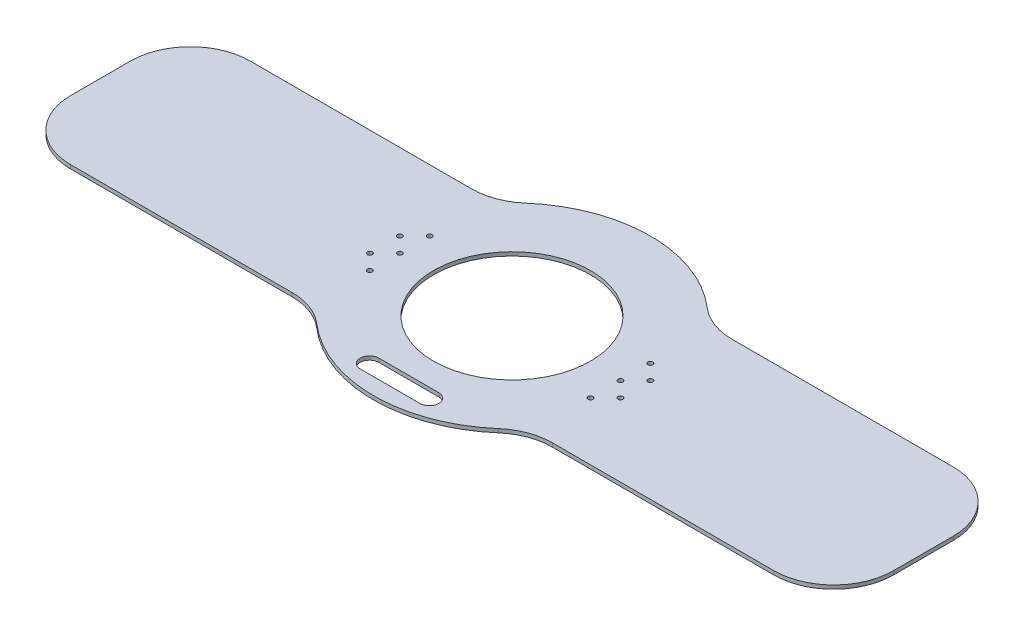
ISO-10303-21;
HEADER;
FILE_DESCRIPTION(('STEP AP214'),'2;1');
FILE_NAME('part.step','',(''),(''),'','','');
FILE_SCHEMA(('AUTOMOTIVE_DESIGN { 1 0 10303 214 1 1 1 1 }'));
ENDSEC;
DATA;
#1=APPLICATION_CONTEXT('core data for automotive mechanical design processes');
#2=APPLICATION_PROTOCOL_DEFINITION('international standard','automotive_design',2000,#1);
#3=PRODUCT_CONTEXT('',#1,'mechanical');
#4=PRODUCT('Part','Part','',(#3));
#5=PRODUCT_RELATED_PRODUCT_CATEGORY('part','',(#4));
#6=PRODUCT_DEFINITION_FORMATION('','',#4);
#7=PRODUCT_DEFINITION_CONTEXT('part definition',#1,'design');
#8=PRODUCT_DEFINITION('design','',#6,#7);
#9=PRODUCT_DEFINITION_SHAPE('','',#8);
#10=(LENGTH_UNIT() NAMED_UNIT(*) SI_UNIT(.MILLI.,.METRE.));
#11=(NAMED_UNIT(*) PLANE_ANGLE_UNIT() SI_UNIT($,.RADIAN.));
#12=(NAMED_UNIT(*) SI_UNIT($,.STERADIAN.) SOLID_ANGLE_UNIT());
#13=UNCERTAINTY_MEASURE_WITH_UNIT(LENGTH_MEASURE(1.E-05),#10,'distance_accuracy_value','');
#14=(GEOMETRIC_REPRESENTATION_CONTEXT(3) GLOBAL_UNCERTAINTY_ASSIGNED_CONTEXT((#13)) GLOBAL_UNIT_ASSIGNED_CONTEXT((#10,
#11,#12)) REPRESENTATION_CONTEXT('',''));
#15=CARTESIAN_POINT('',(0.,0.,0.));
#16=DIRECTION('',(0.,0.,1.));
#17=DIRECTION('',(1.,0.,0.));
#18=AXIS2_PLACEMENT_3D('',#15,#16,#17);
#19=CARTESIAN_POINT('',(-110.396900432032,3.175,127.));
#20=DIRECTION('',(0.,-1.,0.));
#21=DIRECTION('',(0.,0.,-1.));
#22=AXIS2_PLACEMENT_3D('',#19,#20,#21);
#23=CYLINDRICAL_SURFACE('',#22,50.8);
#24=CARTESIAN_POINT('',(-110.396900432032,0.,127.));
#25=DIRECTION('',(0.,1.,0.));
#26=DIRECTION('',(0.,0.,1.));
#27=AXIS2_PLACEMENT_3D('',#24,#25,#26);
#28=CIRCLE('',#27,50.8);
#29=CARTESIAN_POINT('',(-110.396900432032,0.,76.2));
#30=VERTEX_POINT('',#29);
#31=CARTESIAN_POINT('',(-77.0695342638714,0.,88.6603773584906));
#32=VERTEX_POINT('',#31);
#33=EDGE_CURVE('E252',#30,#32,#28,.F.);
#34=ORIENTED_EDGE('',*,*,#33,.T.);
#35=DIRECTION('',(0.,-1.,0.));
#36=VECTOR('',#35,1.);
#37=CARTESIAN_POINT('',(-77.0695342638714,3.175,88.6603773584906));
#38=LINE('',#37,#36);
#39=CARTESIAN_POINT('',(-77.0695342638714,3.175,88.6603773584906));
#40=VERTEX_POINT('',#39);
#41=EDGE_CURVE('E11',#40,#32,#38,.T.);
#42=ORIENTED_EDGE('',*,*,#41,.F.);
#43=CARTESIAN_POINT('',(-110.396900432032,3.175,127.));
#44=DIRECTION('',(0.,1.,0.));
#45=DIRECTION('',(0.,0.,1.));
#46=AXIS2_PLACEMENT_3D('',#43,#44,#45);
#47=CIRCLE('',#46,50.8);
#48=CARTESIAN_POINT('',(-110.396900432032,3.175,76.2));
#49=VERTEX_POINT('',#48);
#50=EDGE_CURVE('E207',#49,#40,#47,.F.);
#51=ORIENTED_EDGE('',*,*,#50,.F.);
#52=DIRECTION('',(0.,-1.,0.));
#53=VECTOR('',#52,1.);
#54=CARTESIAN_POINT('',(-110.396900432032,3.175,76.2));
#55=LINE('',#54,#53);
#56=EDGE_CURVE('E249',#49,#30,#55,.T.);
#57=ORIENTED_EDGE('',*,*,#56,.T.);
#58=EDGE_LOOP('',(#34,#42,#51,#57));
#59=FACE_BOUND('',#58,.T.);
#60=ADVANCED_FACE('F35',(#59),#23,.F.);
#61=CARTESIAN_POINT('',(0.,3.175,0.));
#62=DIRECTION('',(0.,-1.,0.));
#63=DIRECTION('',(0.,0.,-1.));
#64=AXIS2_PLACEMENT_3D('',#61,#62,#63);
#65=CYLINDRICAL_SURFACE('',#64,117.475);
#66=CARTESIAN_POINT('',(0.,0.,0.));
#67=DIRECTION('',(0.,1.,0.));
#68=DIRECTION('',(0.,0.,1.));
#69=AXIS2_PLACEMENT_3D('',#66,#67,#68);
#70=CIRCLE('',#69,117.475);
#71=CARTESIAN_POINT('',(77.0695342638714,0.,88.6603773584905));
#72=VERTEX_POINT('',#71);
#73=EDGE_CURVE('E255',#32,#72,#70,.T.);
#74=ORIENTED_EDGE('',*,*,#73,.T.);
#75=DIRECTION('',(0.,-1.,0.));
#76=VECTOR('',#75,1.);
#77=CARTESIAN_POINT('',(77.0695342638714,3.175,88.6603773584905));
#78=LINE('',#77,#76);
#79=CARTESIAN_POINT('',(77.0695342638714,3.175,88.6603773584905));
#80=VERTEX_POINT('',#79);
#81=EDGE_CURVE('E43',#80,#72,#78,.T.);
#82=ORIENTED_EDGE('',*,*,#81,.F.);
#83=CARTESIAN_POINT('',(0.,3.175,0.));
#84=DIRECTION('',(0.,1.,0.));
#85=DIRECTION('',(0.,0.,1.));
#86=AXIS2_PLACEMENT_3D('',#83,#84,#85);
#87=CIRCLE('',#86,117.475);
#88=EDGE_CURVE('E211',#40,#80,#87,.T.);
#89=ORIENTED_EDGE('',*,*,#88,.F.);
#90=ORIENTED_EDGE('',*,*,#41,.T.);
#91=EDGE_LOOP('',(#74,#82,#89,#90));
#92=FACE_BOUND('',#91,.T.);
#93=ADVANCED_FACE('F331',(#92),#65,.T.);
#94=CARTESIAN_POINT('',(110.396900432032,3.175,127.));
#95=DIRECTION('',(0.,-1.,0.));
#96=DIRECTION('',(0.,0.,-1.));
#97=AXIS2_PLACEMENT_3D('',#94,#95,#96);
#98=CYLINDRICAL_SURFACE('',#97,50.8);
#99=CARTESIAN_POINT('',(110.396900432032,0.,127.));
#100=DIRECTION('',(0.,1.,0.));
#101=DIRECTION('',(0.,0.,1.));
#102=AXIS2_PLACEMENT_3D('',#99,#100,#101);
#103=CIRCLE('',#102,50.8);
#104=CARTESIAN_POINT('',(110.396900432032,0.,76.2));
#105=VERTEX_POINT('',#104);
#106=EDGE_CURVE('E258',#105,#72,#103,.T.);
#107=ORIENTED_EDGE('',*,*,#106,.F.);
#108=DIRECTION('',(0.,-1.,0.));
#109=VECTOR('',#108,1.);
#110=CARTESIAN_POINT('',(110.396900432032,3.175,76.2));
#111=LINE('',#110,#109);
#112=CARTESIAN_POINT('',(110.396900432032,3.175,76.2));
#113=VERTEX_POINT('',#112);
#114=EDGE_CURVE('E324',#113,#105,#111,.T.);
#115=ORIENTED_EDGE('',*,*,#114,.F.);
#116=CARTESIAN_POINT('',(110.396900432032,3.175,127.));
#117=DIRECTION('',(0.,1.,0.));
#118=DIRECTION('',(0.,0.,1.));
#119=AXIS2_PLACEMENT_3D('',#116,#117,#118);
#120=CIRCLE('',#119,50.8);
#121=EDGE_CURVE('E213',#113,#80,#120,.T.);
#122=ORIENTED_EDGE('',*,*,#121,.T.);
#123=ORIENTED_EDGE('',*,*,#81,.T.);
#124=EDGE_LOOP('',(#107,#115,#122,#123));
#125=FACE_BOUND('',#124,.T.);
#126=ADVANCED_FACE('F328',(#125),#98,.F.);
#127=CARTESIAN_POINT('',(0.,3.175,76.2));
#128=DIRECTION('',(0.,0.,1.));
#129=DIRECTION('',(1.,0.,0.));
#130=AXIS2_PLACEMENT_3D('',#127,#128,#129);
#131=PLANE('',#130);
#132=DIRECTION('',(-1.,0.,0.));
#133=VECTOR('',#132,1.);
#134=CARTESIAN_POINT('',(0.,0.,76.2));
#135=LINE('',#134,#133);
#136=CARTESIAN_POINT('',(298.45,0.,76.2));
#137=VERTEX_POINT('',#136);
#138=EDGE_CURVE('E261',#137,#105,#135,.T.);
#139=ORIENTED_EDGE('',*,*,#138,.F.);
#140=DIRECTION('',(0.,-1.,0.));
#141=VECTOR('',#140,1.);
#142=CARTESIAN_POINT('',(298.45,3.175,76.2));
#143=LINE('',#142,#141);
#144=CARTESIAN_POINT('',(298.45,3.175,76.2));
#145=VERTEX_POINT('',#144);
#146=EDGE_CURVE('E322',#145,#137,#143,.T.);
#147=ORIENTED_EDGE('',*,*,#146,.F.);
#148=DIRECTION('',(-1.,0.,0.));
#149=VECTOR('',#148,1.);
#150=CARTESIAN_POINT('',(0.,3.175,76.2));
#151=LINE('',#150,#149);
#152=EDGE_CURVE('E216',#145,#113,#151,.T.);
#153=ORIENTED_EDGE('',*,*,#152,.T.);
#154=ORIENTED_EDGE('',*,*,#114,.T.);
#155=EDGE_LOOP('',(#139,#147,#153,#154));
#156=FACE_BOUND('',#155,.T.);
#157=ADVANCED_FACE('F339',(#156),#131,.T.);
#158=CARTESIAN_POINT('',(298.45,3.175,25.4));
#159=DIRECTION('',(0.,-1.,0.));
#160=DIRECTION('',(0.,0.,-1.));
#161=AXIS2_PLACEMENT_3D('',#158,#159,#160);
#162=CYLINDRICAL_SURFACE('',#161,50.8);
#163=CARTESIAN_POINT('',(298.45,0.,25.4));
#164=DIRECTION('',(0.,1.,0.));
#165=DIRECTION('',(0.,0.,1.));
#166=AXIS2_PLACEMENT_3D('',#163,#164,#165);
#167=CIRCLE('',#166,50.8);
#168=CARTESIAN_POINT('',(349.25,0.,25.4));
#169=VERTEX_POINT('',#168);
#170=EDGE_CURVE('E264',#169,#137,#167,.F.);
#171=ORIENTED_EDGE('',*,*,#170,.F.);
#172=DIRECTION('',(0.,-1.,0.));
#173=VECTOR('',#172,1.);
#174=CARTESIAN_POINT('',(349.25,3.175,25.4));
#175=LINE('',#174,#173);
#176=CARTESIAN_POINT('',(349.25,3.175,25.4));
#177=VERTEX_POINT('',#176);
#178=EDGE_CURVE('E320',#177,#169,#175,.T.);
#179=ORIENTED_EDGE('',*,*,#178,.F.);
#180=CARTESIAN_POINT('',(298.45,3.175,25.4));
#181=DIRECTION('',(0.,1.,0.));
#182=DIRECTION('',(0.,0.,1.));
#183=AXIS2_PLACEMENT_3D('',#180,#181,#182);
#184=CIRCLE('',#183,50.8);
#185=EDGE_CURVE('E219',#177,#145,#184,.F.);
#186=ORIENTED_EDGE('',*,*,#185,.T.);
#187=ORIENTED_EDGE('',*,*,#146,.T.);
#188=EDGE_LOOP('',(#171,#179,#186,#187));
#189=FACE_BOUND('',#188,.T.);
#190=ADVANCED_FACE('F396',(#189),#162,.T.);
#191=CARTESIAN_POINT('',(349.25,3.175,0.));
#192=DIRECTION('',(1.,0.,0.));
#193=DIRECTION('',(0.,0.,-1.));
#194=AXIS2_PLACEMENT_3D('',#191,#192,#193);
#195=PLANE('',#194);
#196=DIRECTION('',(0.,0.,1.));
#197=VECTOR('',#196,1.);
#198=CARTESIAN_POINT('',(349.25,0.,0.));
#199=LINE('',#198,#197);
#200=CARTESIAN_POINT('',(349.25,0.,-25.4000000000001));
#201=VERTEX_POINT('',#200);
#202=EDGE_CURVE('E267',#201,#169,#199,.T.);
#203=ORIENTED_EDGE('',*,*,#202,.F.);
#204=DIRECTION('',(0.,-1.,0.));
#205=VECTOR('',#204,1.);
#206=CARTESIAN_POINT('',(349.25,3.175,-25.4000000000001));
#207=LINE('',#206,#205);
#208=CARTESIAN_POINT('',(349.25,3.175,-25.4000000000001));
#209=VERTEX_POINT('',#208);
#210=EDGE_CURVE('E318',#209,#201,#207,.T.);
#211=ORIENTED_EDGE('',*,*,#210,.F.);
#212=DIRECTION('',(0.,0.,1.));
#213=VECTOR('',#212,1.);
#214=CARTESIAN_POINT('',(349.25,3.175,0.));
#215=LINE('',#214,#213);
#216=EDGE_CURVE('E222',#209,#177,#215,.T.);
#217=ORIENTED_EDGE('',*,*,#216,.T.);
#218=ORIENTED_EDGE('',*,*,#178,.T.);
#219=EDGE_LOOP('',(#203,#211,#217,#218));
#220=FACE_BOUND('',#219,.T.);
#221=ADVANCED_FACE('F393',(#220),#195,.T.);
#222=CARTESIAN_POINT('',(298.45,3.175,-25.4000000000001));
#223=DIRECTION('',(0.,-1.,0.));
#224=DIRECTION('',(0.,0.,-1.));
#225=AXIS2_PLACEMENT_3D('',#222,#223,#224);
#226=CYLINDRICAL_SURFACE('',#225,50.8);
#227=CARTESIAN_POINT('',(298.45,0.,-25.4000000000001));
#228=DIRECTION('',(0.,1.,0.));
#229=DIRECTION('',(0.,0.,1.));
#230=AXIS2_PLACEMENT_3D('',#227,#228,#229);
#231=CIRCLE('',#230,50.8);
#232=CARTESIAN_POINT('',(298.45,0.,-76.2000000000001));
#233=VERTEX_POINT('',#232);
#234=EDGE_CURVE('E270',#233,#201,#231,.F.);
#235=ORIENTED_EDGE('',*,*,#234,.F.);
#236=DIRECTION('',(0.,-1.,0.));
#237=VECTOR('',#236,1.);
#238=CARTESIAN_POINT('',(298.45,3.175,-76.2000000000001));
#239=LINE('',#238,#237);
#240=CARTESIAN_POINT('',(298.45,3.175,-76.2000000000001));
#241=VERTEX_POINT('',#240);
#242=EDGE_CURVE('E316',#241,#233,#239,.T.);
#243=ORIENTED_EDGE('',*,*,#242,.F.);
#244=CARTESIAN_POINT('',(298.45,3.175,-25.4000000000001));
#245=DIRECTION('',(0.,1.,0.));
#246=DIRECTION('',(0.,0.,1.));
#247=AXIS2_PLACEMENT_3D('',#244,#245,#246);
#248=CIRCLE('',#247,50.8);
#249=EDGE_CURVE('E225',#241,#209,#248,.F.);
#250=ORIENTED_EDGE('',*,*,#249,.T.);
#251=ORIENTED_EDGE('',*,*,#210,.T.);
#252=EDGE_LOOP('',(#235,#243,#250,#251));
#253=FACE_BOUND('',#252,.T.);
#254=ADVANCED_FACE('F390',(#253),#226,.T.);
#255=CARTESIAN_POINT('',(0.,3.175,-76.2));
#256=DIRECTION('',(0.,0.,1.));
#257=DIRECTION('',(1.,0.,0.));
#258=AXIS2_PLACEMENT_3D('',#255,#256,#257);
#259=PLANE('',#258);
#260=DIRECTION('',(-1.,0.,0.));
#261=VECTOR('',#260,1.);
#262=CARTESIAN_POINT('',(0.,0.,-76.2));
#263=LINE('',#262,#261);
#264=CARTESIAN_POINT('',(110.396900432032,0.,-76.2));
#265=VERTEX_POINT('',#264);
#266=EDGE_CURVE('E273',#233,#265,#263,.T.);
#267=ORIENTED_EDGE('',*,*,#266,.T.);
#268=DIRECTION('',(0.,-1.,0.));
#269=VECTOR('',#268,1.);
#270=CARTESIAN_POINT('',(110.396900432032,3.175,-76.2));
#271=LINE('',#270,#269);
#272=CARTESIAN_POINT('',(110.396900432032,3.175,-76.2));
#273=VERTEX_POINT('',#272);
#274=EDGE_CURVE('E313',#273,#265,#271,.T.);
#275=ORIENTED_EDGE('',*,*,#274,.F.);
#276=DIRECTION('',(-1.,0.,0.));
#277=VECTOR('',#276,1.);
#278=CARTESIAN_POINT('',(0.,3.175,-76.2));
#279=LINE('',#278,#277);
#280=EDGE_CURVE('E228',#241,#273,#279,.T.);
#281=ORIENTED_EDGE('',*,*,#280,.F.);
#282=ORIENTED_EDGE('',*,*,#242,.T.);
#283=EDGE_LOOP('',(#267,#275,#281,#282));
#284=FACE_BOUND('',#283,.T.);
#285=ADVANCED_FACE('F387',(#284),#259,.F.);
#286=CARTESIAN_POINT('',(110.396900432032,3.175,-127.));
#287=DIRECTION('',(0.,-1.,0.));
#288=DIRECTION('',(0.,0.,-1.));
#289=AXIS2_PLACEMENT_3D('',#286,#287,#288);
#290=CYLINDRICAL_SURFACE('',#289,50.8);
#291=CARTESIAN_POINT('',(110.396900432032,0.,-127.));
#292=DIRECTION('',(0.,1.,0.));
#293=DIRECTION('',(0.,0.,1.));
#294=AXIS2_PLACEMENT_3D('',#291,#292,#293);
#295=CIRCLE('',#294,50.8);
#296=CARTESIAN_POINT('',(77.0695342638714,0.,-88.6603773584905));
#297=VERTEX_POINT('',#296);
#298=EDGE_CURVE('E275',#265,#297,#295,.F.);
#299=ORIENTED_EDGE('',*,*,#298,.T.);
#300=DIRECTION('',(0.,-1.,0.));
#301=VECTOR('',#300,1.);
#302=CARTESIAN_POINT('',(77.0695342638714,3.175,-88.6603773584905));
#303=LINE('',#302,#301);
#304=CARTESIAN_POINT('',(77.0695342638714,3.175,-88.6603773584905));
#305=VERTEX_POINT('',#304);
#306=EDGE_CURVE('E310',#305,#297,#303,.T.);
#307=ORIENTED_EDGE('',*,*,#306,.F.);
#308=CARTESIAN_POINT('',(110.396900432032,3.175,-127.));
#309=DIRECTION('',(0.,1.,0.));
#310=DIRECTION('',(0.,0.,1.));
#311=AXIS2_PLACEMENT_3D('',#308,#309,#310);
#312=CIRCLE('',#311,50.8);
#313=EDGE_CURVE('E230',#273,#305,#312,.F.);
#314=ORIENTED_EDGE('',*,*,#313,.F.);
#315=ORIENTED_EDGE('',*,*,#274,.T.);
#316=EDGE_LOOP('',(#299,#307,#314,#315));
#317=FACE_BOUND('',#316,.T.);
#318=ADVANCED_FACE('F382',(#317),#290,.F.);
#319=CARTESIAN_POINT('',(0.,3.175,0.));
#320=DIRECTION('',(0.,-1.,0.));
#321=DIRECTION('',(0.,0.,-1.));
#322=AXIS2_PLACEMENT_3D('',#319,#320,#321);
#323=CYLINDRICAL_SURFACE('',#322,117.475);
#324=CARTESIAN_POINT('',(0.,0.,0.));
#325=DIRECTION('',(0.,1.,0.));
#326=DIRECTION('',(0.,0.,1.));
#327=AXIS2_PLACEMENT_3D('',#324,#325,#326);
#328=CIRCLE('',#327,117.475);
#329=CARTESIAN_POINT('',(-77.0695342638714,0.,-88.6603773584906));
#330=VERTEX_POINT('',#329);
#331=EDGE_CURVE('E277',#297,#330,#328,.T.);
#332=ORIENTED_EDGE('',*,*,#331,.T.);
#333=DIRECTION('',(0.,-1.,0.));
#334=VECTOR('',#333,1.);
#335=CARTESIAN_POINT('',(-77.0695342638714,3.175,-88.6603773584906));
#336=LINE('',#335,#334);
#337=CARTESIAN_POINT('',(-77.0695342638714,3.175,-88.6603773584906));
#338=VERTEX_POINT('',#337);
#339=EDGE_CURVE('E308',#338,#330,#336,.T.);
#340=ORIENTED_EDGE('',*,*,#339,.F.);
#341=CARTESIAN_POINT('',(0.,3.175,0.));
#342=DIRECTION('',(0.,1.,0.));
#343=DIRECTION('',(0.,0.,1.));
#344=AXIS2_PLACEMENT_3D('',#341,#342,#343);
#345=CIRCLE('',#344,117.475);
#346=EDGE_CURVE('E232',#305,#338,#345,.T.);
#347=ORIENTED_EDGE('',*,*,#346,.F.);
#348=ORIENTED_EDGE('',*,*,#306,.T.);
#349=EDGE_LOOP('',(#332,#340,#347,#348));
#350=FACE_BOUND('',#349,.T.);
#351=ADVANCED_FACE('F376',(#350),#323,.T.);
#352=CARTESIAN_POINT('',(-110.396900432032,3.175,-127.));
#353=DIRECTION('',(0.,-1.,0.));
#354=DIRECTION('',(0.,0.,-1.));
#355=AXIS2_PLACEMENT_3D('',#352,#353,#354);
#356=CYLINDRICAL_SURFACE('',#355,50.8);
#357=CARTESIAN_POINT('',(-110.396900432032,0.,-127.));
#358=DIRECTION('',(0.,1.,0.));
#359=DIRECTION('',(0.,0.,1.));
#360=AXIS2_PLACEMENT_3D('',#357,#358,#359);
#361=CIRCLE('',#360,50.8);
#362=CARTESIAN_POINT('',(-110.396900432032,0.,-76.2));
#363=VERTEX_POINT('',#362);
#364=EDGE_CURVE('E280',#363,#330,#361,.T.);
#365=ORIENTED_EDGE('',*,*,#364,.F.);
#366=DIRECTION('',(0.,-1.,0.));
#367=VECTOR('',#366,1.);
#368=CARTESIAN_POINT('',(-110.396900432032,3.175,-76.2));
#369=LINE('',#368,#367);
#370=CARTESIAN_POINT('',(-110.396900432032,3.175,-76.2));
#371=VERTEX_POINT('',#370);
#372=EDGE_CURVE('E306',#371,#363,#369,.T.);
#373=ORIENTED_EDGE('',*,*,#372,.F.);
#374=CARTESIAN_POINT('',(-110.396900432032,3.175,-127.));
#375=DIRECTION('',(0.,1.,0.));
#376=DIRECTION('',(0.,0.,1.));
#377=AXIS2_PLACEMENT_3D('',#374,#375,#376);
#378=CIRCLE('',#377,50.8);
#379=EDGE_CURVE('E234',#371,#338,#378,.T.);
#380=ORIENTED_EDGE('',*,*,#379,.T.);
#381=ORIENTED_EDGE('',*,*,#339,.T.);
#382=EDGE_LOOP('',(#365,#373,#380,#381));
#383=FACE_BOUND('',#382,.T.);
#384=ADVANCED_FACE('F372',(#383),#356,.F.);
#385=CARTESIAN_POINT('',(0.,3.175,-76.2));
#386=DIRECTION('',(0.,0.,1.));
#387=DIRECTION('',(1.,0.,0.));
#388=AXIS2_PLACEMENT_3D('',#385,#386,#387);
#389=PLANE('',#388);
#390=DIRECTION('',(-1.,0.,0.));
#391=VECTOR('',#390,1.);
#392=CARTESIAN_POINT('',(0.,0.,-76.2));
#393=LINE('',#392,#391);
#394=CARTESIAN_POINT('',(-298.45,0.,-76.2));
#395=VERTEX_POINT('',#394);
#396=EDGE_CURVE('E283',#363,#395,#393,.T.);
#397=ORIENTED_EDGE('',*,*,#396,.T.);
#398=DIRECTION('',(0.,-1.,0.));
#399=VECTOR('',#398,1.);
#400=CARTESIAN_POINT('',(-298.45,3.175,-76.2));
#401=LINE('',#400,#399);
#402=CARTESIAN_POINT('',(-298.45,3.175,-76.2));
#403=VERTEX_POINT('',#402);
#404=EDGE_CURVE('E303',#403,#395,#401,.T.);
#405=ORIENTED_EDGE('',*,*,#404,.F.);
#406=DIRECTION('',(-1.,0.,0.));
#407=VECTOR('',#406,1.);
#408=CARTESIAN_POINT('',(0.,3.175,-76.2));
#409=LINE('',#408,#407);
#410=EDGE_CURVE('E237',#371,#403,#409,.T.);
#411=ORIENTED_EDGE('',*,*,#410,.F.);
#412=ORIENTED_EDGE('',*,*,#372,.T.);
#413=EDGE_LOOP('',(#397,#405,#411,#412));
#414=FACE_BOUND('',#413,.T.);
#415=ADVANCED_FACE('F367',(#414),#389,.F.);
#416=CARTESIAN_POINT('',(-298.45,3.175,-25.4));
#417=DIRECTION('',(0.,-1.,0.));
#418=DIRECTION('',(0.,0.,-1.));
#419=AXIS2_PLACEMENT_3D('',#416,#417,#418);
#420=CYLINDRICAL_SURFACE('',#419,50.8);
#421=CARTESIAN_POINT('',(-298.45,0.,-25.4));
#422=DIRECTION('',(0.,1.,0.));
#423=DIRECTION('',(0.,0.,1.));
#424=AXIS2_PLACEMENT_3D('',#421,#422,#423);
#425=CIRCLE('',#424,50.8);
#426=CARTESIAN_POINT('',(-349.25,0.,-25.4));
#427=VERTEX_POINT('',#426);
#428=EDGE_CURVE('E285',#395,#427,#425,.T.);
#429=ORIENTED_EDGE('',*,*,#428,.T.);
#430=DIRECTION('',(0.,-1.,0.));
#431=VECTOR('',#430,1.);
#432=CARTESIAN_POINT('',(-349.25,3.175,-25.4));
#433=LINE('',#432,#431);
#434=CARTESIAN_POINT('',(-349.25,3.175,-25.4));
#435=VERTEX_POINT('',#434);
#436=EDGE_CURVE('E300',#435,#427,#433,.T.);
#437=ORIENTED_EDGE('',*,*,#436,.F.);
#438=CARTESIAN_POINT('',(-298.45,3.175,-25.4));
#439=DIRECTION('',(0.,1.,0.));
#440=DIRECTION('',(0.,0.,1.));
#441=AXIS2_PLACEMENT_3D('',#438,#439,#440);
#442=CIRCLE('',#441,50.8);
#443=EDGE_CURVE('E239',#403,#435,#442,.T.);
#444=ORIENTED_EDGE('',*,*,#443,.F.);
#445=ORIENTED_EDGE('',*,*,#404,.T.);
#446=EDGE_LOOP('',(#429,#437,#444,#445));
#447=FACE_BOUND('',#446,.T.);
#448=ADVANCED_FACE('F363',(#447),#420,.T.);
#449=CARTESIAN_POINT('',(-349.25,3.175,0.));
#450=DIRECTION('',(1.,0.,0.));
#451=DIRECTION('',(0.,0.,-1.));
#452=AXIS2_PLACEMENT_3D('',#449,#450,#451);
#453=PLANE('',#452);
#454=DIRECTION('',(0.,0.,1.));
#455=VECTOR('',#454,1.);
#456=CARTESIAN_POINT('',(-349.25,0.,0.));
#457=LINE('',#456,#455);
#458=CARTESIAN_POINT('',(-349.25,0.,25.4));
#459=VERTEX_POINT('',#458);
#460=EDGE_CURVE('E287',#427,#459,#457,.T.);
#461=ORIENTED_EDGE('',*,*,#460,.T.);
#462=DIRECTION('',(0.,-1.,0.));
#463=VECTOR('',#462,1.);
#464=CARTESIAN_POINT('',(-349.25,3.175,25.4));
#465=LINE('',#464,#463);
#466=CARTESIAN_POINT('',(-349.25,3.175,25.4));
#467=VERTEX_POINT('',#466);
#468=EDGE_CURVE('E298',#467,#459,#465,.T.);
#469=ORIENTED_EDGE('',*,*,#468,.F.);
#470=DIRECTION('',(0.,0.,1.));
#471=VECTOR('',#470,1.);
#472=CARTESIAN_POINT('',(-349.25,3.175,0.));
#473=LINE('',#472,#471);
#474=EDGE_CURVE('E241',#435,#467,#473,.T.);
#475=ORIENTED_EDGE('',*,*,#474,.F.);
#476=ORIENTED_EDGE('',*,*,#436,.T.);
#477=EDGE_LOOP('',(#461,#469,#475,#476));
#478=FACE_BOUND('',#477,.T.);
#479=ADVANCED_FACE('F358',(#478),#453,.F.);
#480=CARTESIAN_POINT('',(-298.45,3.175,25.4));
#481=DIRECTION('',(0.,-1.,0.));
#482=DIRECTION('',(0.,0.,-1.));
#483=AXIS2_PLACEMENT_3D('',#480,#481,#482);
#484=CYLINDRICAL_SURFACE('',#483,50.8);
#485=CARTESIAN_POINT('',(-298.45,0.,25.4));
#486=DIRECTION('',(0.,1.,0.));
#487=DIRECTION('',(0.,0.,1.));
#488=AXIS2_PLACEMENT_3D('',#485,#486,#487);
#489=CIRCLE('',#488,50.8);
#490=CARTESIAN_POINT('',(-298.45,0.,76.2));
#491=VERTEX_POINT('',#490);
#492=EDGE_CURVE('E290',#491,#459,#489,.F.);
#493=ORIENTED_EDGE('',*,*,#492,.F.);
#494=DIRECTION('',(0.,-1.,0.));
#495=VECTOR('',#494,1.);
#496=CARTESIAN_POINT('',(-298.45,3.175,76.2));
#497=LINE('',#496,#495);
#498=CARTESIAN_POINT('',(-298.45,3.175,76.2));
#499=VERTEX_POINT('',#498);
#500=EDGE_CURVE('E296',#499,#491,#497,.T.);
#501=ORIENTED_EDGE('',*,*,#500,.F.);
#502=CARTESIAN_POINT('',(-298.45,3.175,25.4));
#503=DIRECTION('',(0.,1.,0.));
#504=DIRECTION('',(0.,0.,1.));
#505=AXIS2_PLACEMENT_3D('',#502,#503,#504);
#506=CIRCLE('',#505,50.8);
#507=EDGE_CURVE('E243',#499,#467,#506,.F.);
#508=ORIENTED_EDGE('',*,*,#507,.T.);
#509=ORIENTED_EDGE('',*,*,#468,.T.);
#510=EDGE_LOOP('',(#493,#501,#508,#509));
#511=FACE_BOUND('',#510,.T.);
#512=ADVANCED_FACE('F352',(#511),#484,.T.);
#513=CARTESIAN_POINT('',(0.,3.175,0.));
#514=DIRECTION('',(0.,-1.,0.));
#515=DIRECTION('',(0.,0.,-1.));
#516=AXIS2_PLACEMENT_3D('',#513,#514,#515);
#517=CYLINDRICAL_SURFACE('',#516,66.675);
#518=CARTESIAN_POINT('',(0.,3.175,0.));
#519=DIRECTION('',(0.,1.,0.));
#520=DIRECTION('',(0.,0.,1.));
#521=AXIS2_PLACEMENT_3D('',#518,#519,#520);
#522=CIRCLE('',#521,66.675);
#523=CARTESIAN_POINT('',(0.,3.175,66.675));
#524=VERTEX_POINT('',#523);
#525=EDGE_CURVE('E204',#524,#524,#522,.T.);
#526=ORIENTED_EDGE('',*,*,#525,.T.);
#527=EDGE_LOOP('',(#526));
#528=FACE_BOUND('',#527,.T.);
#529=CARTESIAN_POINT('',(0.,0.,0.));
#530=DIRECTION('',(0.,1.,0.));
#531=DIRECTION('',(0.,0.,1.));
#532=AXIS2_PLACEMENT_3D('',#529,#530,#531);
#533=CIRCLE('',#532,66.675);
#534=CARTESIAN_POINT('',(0.,0.,66.675));
#535=VERTEX_POINT('',#534);
#536=EDGE_CURVE('E202',#535,#535,#533,.T.);
#537=ORIENTED_EDGE('',*,*,#536,.F.);
#538=EDGE_LOOP('',(#537));
#539=FACE_BOUND('',#538,.T.);
#540=ADVANCED_FACE('F37',(#528,#539),#517,.F.);
#541=CARTESIAN_POINT('',(0.,3.175,76.2));
#542=DIRECTION('',(0.,0.,1.));
#543=DIRECTION('',(1.,0.,0.));
#544=AXIS2_PLACEMENT_3D('',#541,#542,#543);
#545=PLANE('',#544);
#546=DIRECTION('',(-1.,0.,0.));
#547=VECTOR('',#546,1.);
#548=CARTESIAN_POINT('',(0.,0.,76.2));
#549=LINE('',#548,#547);
#550=EDGE_CURVE('E208',#30,#491,#549,.T.);
#551=ORIENTED_EDGE('',*,*,#550,.F.);
#552=ORIENTED_EDGE('',*,*,#56,.F.);
#553=DIRECTION('',(-1.,0.,0.));
#554=VECTOR('',#553,1.);
#555=CARTESIAN_POINT('',(0.,3.175,76.2));
#556=LINE('',#555,#554);
#557=EDGE_CURVE('E246',#49,#499,#556,.T.);
#558=ORIENTED_EDGE('',*,*,#557,.T.);
#559=ORIENTED_EDGE('',*,*,#500,.T.);
#560=EDGE_LOOP('',(#551,#552,#558,#559));
#561=FACE_BOUND('',#560,.T.);
#562=ADVANCED_FACE('F349',(#561),#545,.T.);
#563=CARTESIAN_POINT('',(0.,3.175,0.));
#564=DIRECTION('',(0.,1.,0.));
#565=DIRECTION('',(0.,0.,1.));
#566=AXIS2_PLACEMENT_3D('',#563,#564,#565);
#567=PLANE('',#566);
#568=CARTESIAN_POINT('',(-106.3244,3.175,14.2875));
#569=DIRECTION('',(0.,1.,0.));
#570=DIRECTION('',(0.,0.,1.));
#571=AXIS2_PLACEMENT_3D('',#568,#569,#570);
#572=CIRCLE('',#571,2.0955);
#573=CARTESIAN_POINT('',(-106.3244,3.175,16.383));
#574=VERTEX_POINT('',#573);
#575=EDGE_CURVE('E681',#574,#574,#572,.T.);
#576=ORIENTED_EDGE('',*,*,#575,.F.);
#577=EDGE_LOOP('',(#576));
#578=FACE_BOUND('',#577,.T.);
#579=CARTESIAN_POINT('',(-93.6244000000001,3.175,1.58750000000001));
#580=DIRECTION('',(0.,1.,0.));
#581=DIRECTION('',(0.,0.,1.));
#582=AXIS2_PLACEMENT_3D('',#579,#580,#581);
#583=CIRCLE('',#582,2.0955);
#584=CARTESIAN_POINT('',(-93.6244000000001,3.175,3.68300000000001));
#585=VERTEX_POINT('',#584);
#586=EDGE_CURVE('E687',#585,#585,#583,.T.);
#587=ORIENTED_EDGE('',*,*,#586,.F.);
#588=EDGE_LOOP('',(#587));
#589=FACE_BOUND('',#588,.T.);
#590=CARTESIAN_POINT('',(-106.3244,3.175,-11.1125));
#591=DIRECTION('',(0.,1.,0.));
#592=DIRECTION('',(0.,0.,1.));
#593=AXIS2_PLACEMENT_3D('',#590,#591,#592);
#594=CIRCLE('',#593,2.0955);
#595=CARTESIAN_POINT('',(-106.3244,3.175,-9.01699999999999));
#596=VERTEX_POINT('',#595);
#597=EDGE_CURVE('E695',#596,#596,#594,.T.);
#598=ORIENTED_EDGE('',*,*,#597,.F.);
#599=EDGE_LOOP('',(#598));
#600=FACE_BOUND('',#599,.T.);
#601=CARTESIAN_POINT('',(-93.6244000000001,3.175,-23.8125));
#602=DIRECTION('',(0.,1.,0.));
#603=DIRECTION('',(0.,0.,1.));
#604=AXIS2_PLACEMENT_3D('',#601,#602,#603);
#605=CIRCLE('',#604,2.0955);
#606=CARTESIAN_POINT('',(-93.6244000000001,3.175,-21.717));
#607=VERTEX_POINT('',#606);
#608=EDGE_CURVE('E701',#607,#607,#605,.T.);
#609=ORIENTED_EDGE('',*,*,#608,.F.);
#610=EDGE_LOOP('',(#609));
#611=FACE_BOUND('',#610,.T.);
#612=CARTESIAN_POINT('',(93.6244000000001,3.175,26.9875));
#613=DIRECTION('',(0.,1.,0.));
#614=DIRECTION('',(0.,0.,-1.));
#615=AXIS2_PLACEMENT_3D('',#612,#613,#614);
#616=CIRCLE('',#615,2.0955);
#617=CARTESIAN_POINT('',(93.6244000000001,3.175,24.892));
#618=VERTEX_POINT('',#617);
#619=EDGE_CURVE('E707',#618,#618,#616,.T.);
#620=ORIENTED_EDGE('',*,*,#619,.F.);
#621=EDGE_LOOP('',(#620));
#622=FACE_BOUND('',#621,.T.);
#623=CARTESIAN_POINT('',(106.3244,3.175,14.2875));
#624=DIRECTION('',(0.,1.,0.));
#625=DIRECTION('',(0.,0.,-1.));
#626=AXIS2_PLACEMENT_3D('',#623,#624,#625);
#627=CIRCLE('',#626,2.0955);
#628=CARTESIAN_POINT('',(106.3244,3.175,12.192));
#629=VERTEX_POINT('',#628);
#630=EDGE_CURVE('E713',#629,#629,#627,.T.);
#631=ORIENTED_EDGE('',*,*,#630,.F.);
#632=EDGE_LOOP('',(#631));
#633=FACE_BOUND('',#632,.T.);
#634=CARTESIAN_POINT('',(93.6244000000001,3.175,1.58750000000001));
#635=DIRECTION('',(0.,1.,0.));
#636=DIRECTION('',(0.,0.,-1.));
#637=AXIS2_PLACEMENT_3D('',#634,#635,#636);
#638=CIRCLE('',#637,2.0955);
#639=CARTESIAN_POINT('',(93.6244000000001,3.175,-0.507999999999995));
#640=VERTEX_POINT('',#639);
#641=EDGE_CURVE('E719',#640,#640,#638,.T.);
#642=ORIENTED_EDGE('',*,*,#641,.F.);
#643=EDGE_LOOP('',(#642));
#644=FACE_BOUND('',#643,.T.);
#645=CARTESIAN_POINT('',(106.3244,3.175,-11.1125));
#646=DIRECTION('',(0.,1.,0.));
#647=DIRECTION('',(0.,0.,-1.));
#648=AXIS2_PLACEMENT_3D('',#645,#646,#647);
#649=CIRCLE('',#648,2.0955);
#650=CARTESIAN_POINT('',(106.3244,3.175,-13.208));
#651=VERTEX_POINT('',#650);
#652=EDGE_CURVE('E725',#651,#651,#649,.T.);
#653=ORIENTED_EDGE('',*,*,#652,.F.);
#654=EDGE_LOOP('',(#653));
#655=FACE_BOUND('',#654,.T.);
#656=CARTESIAN_POINT('',(93.6244000000001,3.175,-23.8125));
#657=DIRECTION('',(0.,1.,0.));
#658=DIRECTION('',(0.,0.,-1.));
#659=AXIS2_PLACEMENT_3D('',#656,#657,#658);
#660=CIRCLE('',#659,2.0955);
#661=CARTESIAN_POINT('',(93.6244000000001,3.175,-25.908));
#662=VERTEX_POINT('',#661);
#663=EDGE_CURVE('E731',#662,#662,#660,.T.);
#664=ORIENTED_EDGE('',*,*,#663,.F.);
#665=EDGE_LOOP('',(#664));
#666=FACE_BOUND('',#665,.T.);
#667=CARTESIAN_POINT('',(-93.6244000000001,3.175,26.9875));
#668=DIRECTION('',(0.,1.,0.));
#669=DIRECTION('',(0.,0.,1.));
#670=AXIS2_PLACEMENT_3D('',#667,#668,#669);
#671=CIRCLE('',#670,2.0955);
#672=CARTESIAN_POINT('',(-93.6244000000001,3.175,29.083));
#673=VERTEX_POINT('',#672);
#674=EDGE_CURVE('E684',#673,#673,#671,.T.);
#675=ORIENTED_EDGE('',*,*,#674,.F.);
#676=EDGE_LOOP('',(#675));
#677=FACE_BOUND('',#676,.T.);
#678=CARTESIAN_POINT('',(-25.4,3.175,95.49961469));
#679=DIRECTION('',(0.,1.,0.));
#680=DIRECTION('',(0.,0.,1.));
#681=AXIS2_PLACEMENT_3D('',#678,#679,#680);
#682=CIRCLE('',#681,7.9375);
#683=CARTESIAN_POINT('',(-25.4,3.175,87.56211469));
#684=VERTEX_POINT('',#683);
#685=CARTESIAN_POINT('',(-25.4,3.175,103.43711469));
#686=VERTEX_POINT('',#685);
#687=EDGE_CURVE('E50',#684,#686,#682,.T.);
#688=ORIENTED_EDGE('',*,*,#687,.F.);
#689=DIRECTION('',(-1.,0.,0.));
#690=VECTOR('',#689,1.);
#691=CARTESIAN_POINT('',(-25.4,3.175,87.56211469));
#692=LINE('',#691,#690);
#693=CARTESIAN_POINT('',(25.4,3.175,87.56211469));
#694=VERTEX_POINT('',#693);
#695=EDGE_CURVE('E191',#694,#684,#692,.T.);
#696=ORIENTED_EDGE('',*,*,#695,.F.);
#697=CARTESIAN_POINT('',(25.4,3.175,95.49961469));
#698=DIRECTION('',(0.,1.,0.));
#699=DIRECTION('',(0.,0.,1.));
#700=AXIS2_PLACEMENT_3D('',#697,#698,#699);
#701=CIRCLE('',#700,7.9375);
#702=CARTESIAN_POINT('',(25.4,3.175,103.43711469));
#703=VERTEX_POINT('',#702);
#704=EDGE_CURVE('E175',#703,#694,#701,.T.);
#705=ORIENTED_EDGE('',*,*,#704,.F.);
#706=DIRECTION('',(1.,0.,0.));
#707=VECTOR('',#706,1.);
#708=CARTESIAN_POINT('',(-25.4,3.175,103.43711469));
#709=LINE('',#708,#707);
#710=EDGE_CURVE('E184',#686,#703,#709,.T.);
#711=ORIENTED_EDGE('',*,*,#710,.F.);
#712=EDGE_LOOP('',(#688,#696,#705,#711));
#713=FACE_BOUND('',#712,.T.);
#714=ORIENTED_EDGE('',*,*,#525,.F.);
#715=EDGE_LOOP('',(#714));
#716=FACE_BOUND('',#715,.T.);
#717=ORIENTED_EDGE('',*,*,#50,.T.);
#718=ORIENTED_EDGE('',*,*,#88,.T.);
#719=ORIENTED_EDGE('',*,*,#121,.F.);
#720=ORIENTED_EDGE('',*,*,#152,.F.);
#721=ORIENTED_EDGE('',*,*,#185,.F.);
#722=ORIENTED_EDGE('',*,*,#216,.F.);
#723=ORIENTED_EDGE('',*,*,#249,.F.);
#724=ORIENTED_EDGE('',*,*,#280,.T.);
#725=ORIENTED_EDGE('',*,*,#313,.T.);
#726=ORIENTED_EDGE('',*,*,#346,.T.);
#727=ORIENTED_EDGE('',*,*,#379,.F.);
#728=ORIENTED_EDGE('',*,*,#410,.T.);
#729=ORIENTED_EDGE('',*,*,#443,.T.);
#730=ORIENTED_EDGE('',*,*,#474,.T.);
#731=ORIENTED_EDGE('',*,*,#507,.F.);
#732=ORIENTED_EDGE('',*,*,#557,.F.);
#733=EDGE_LOOP('',(#717,#718,#719,#720,#721,#722,#723,#724,#725,#726,#727,#728,#729,#730,#731,#732));
#734=FACE_BOUND('',#733,.T.);
#735=ADVANCED_FACE('F188',(#578,#589,#600,#611,#622,#633,#644,#655,#666,#677,#713,#716,#734),
#567,.T.);
#736=CARTESIAN_POINT('',(0.,0.,0.));
#737=DIRECTION('',(0.,1.,0.));
#738=DIRECTION('',(0.,0.,1.));
#739=AXIS2_PLACEMENT_3D('',#736,#737,#738);
#740=PLANE('',#739);
#741=CARTESIAN_POINT('',(-106.3244,0.,14.2875));
#742=DIRECTION('',(0.,1.,0.));
#743=DIRECTION('',(0.,0.,1.));
#744=AXIS2_PLACEMENT_3D('',#741,#742,#743);
#745=CIRCLE('',#744,2.0955);
#746=CARTESIAN_POINT('',(-106.3244,0.,16.383));
#747=VERTEX_POINT('',#746);
#748=EDGE_CURVE('E678',#747,#747,#745,.T.);
#749=ORIENTED_EDGE('',*,*,#748,.T.);
#750=EDGE_LOOP('',(#749));
#751=FACE_BOUND('',#750,.T.);
#752=CARTESIAN_POINT('',(-93.6244000000001,0.,1.58750000000001));
#753=DIRECTION('',(0.,1.,0.));
#754=DIRECTION('',(0.,0.,1.));
#755=AXIS2_PLACEMENT_3D('',#752,#753,#754);
#756=CIRCLE('',#755,2.0955);
#757=CARTESIAN_POINT('',(-93.6244000000001,0.,3.68300000000001));
#758=VERTEX_POINT('',#757);
#759=EDGE_CURVE('E682',#758,#758,#756,.T.);
#760=ORIENTED_EDGE('',*,*,#759,.T.);
#761=EDGE_LOOP('',(#760));
#762=FACE_BOUND('',#761,.T.);
#763=CARTESIAN_POINT('',(-106.3244,0.,-11.1125));
#764=DIRECTION('',(0.,1.,0.));
#765=DIRECTION('',(0.,0.,1.));
#766=AXIS2_PLACEMENT_3D('',#763,#764,#765);
#767=CIRCLE('',#766,2.0955);
#768=CARTESIAN_POINT('',(-106.3244,0.,-9.01699999999999));
#769=VERTEX_POINT('',#768);
#770=EDGE_CURVE('E692',#769,#769,#767,.T.);
#771=ORIENTED_EDGE('',*,*,#770,.T.);
#772=EDGE_LOOP('',(#771));
#773=FACE_BOUND('',#772,.T.);
#774=CARTESIAN_POINT('',(-93.6244000000001,0.,-23.8125));
#775=DIRECTION('',(0.,1.,0.));
#776=DIRECTION('',(0.,0.,1.));
#777=AXIS2_PLACEMENT_3D('',#774,#775,#776);
#778=CIRCLE('',#777,2.0955);
#779=CARTESIAN_POINT('',(-93.6244000000001,0.,-21.717));
#780=VERTEX_POINT('',#779);
#781=EDGE_CURVE('E698',#780,#780,#778,.T.);
#782=ORIENTED_EDGE('',*,*,#781,.T.);
#783=EDGE_LOOP('',(#782));
#784=FACE_BOUND('',#783,.T.);
#785=CARTESIAN_POINT('',(93.6244000000001,0.,26.9875));
#786=DIRECTION('',(0.,1.,0.));
#787=DIRECTION('',(0.,0.,-1.));
#788=AXIS2_PLACEMENT_3D('',#785,#786,#787);
#789=CIRCLE('',#788,2.0955);
#790=CARTESIAN_POINT('',(93.6244000000001,0.,24.892));
#791=VERTEX_POINT('',#790);
#792=EDGE_CURVE('E704',#791,#791,#789,.T.);
#793=ORIENTED_EDGE('',*,*,#792,.T.);
#794=EDGE_LOOP('',(#793));
#795=FACE_BOUND('',#794,.T.);
#796=CARTESIAN_POINT('',(106.3244,0.,14.2875));
#797=DIRECTION('',(0.,1.,0.));
#798=DIRECTION('',(0.,0.,-1.));
#799=AXIS2_PLACEMENT_3D('',#796,#797,#798);
#800=CIRCLE('',#799,2.0955);
#801=CARTESIAN_POINT('',(106.3244,0.,12.192));
#802=VERTEX_POINT('',#801);
#803=EDGE_CURVE('E710',#802,#802,#800,.T.);
#804=ORIENTED_EDGE('',*,*,#803,.T.);
#805=EDGE_LOOP('',(#804));
#806=FACE_BOUND('',#805,.T.);
#807=CARTESIAN_POINT('',(93.6244000000001,0.,1.58750000000001));
#808=DIRECTION('',(0.,1.,0.));
#809=DIRECTION('',(0.,0.,-1.));
#810=AXIS2_PLACEMENT_3D('',#807,#808,#809);
#811=CIRCLE('',#810,2.0955);
#812=CARTESIAN_POINT('',(93.6244000000001,0.,-0.507999999999995));
#813=VERTEX_POINT('',#812);
#814=EDGE_CURVE('E716',#813,#813,#811,.T.);
#815=ORIENTED_EDGE('',*,*,#814,.T.);
#816=EDGE_LOOP('',(#815));
#817=FACE_BOUND('',#816,.T.);
#818=CARTESIAN_POINT('',(106.3244,0.,-11.1125));
#819=DIRECTION('',(0.,1.,0.));
#820=DIRECTION('',(0.,0.,-1.));
#821=AXIS2_PLACEMENT_3D('',#818,#819,#820);
#822=CIRCLE('',#821,2.0955);
#823=CARTESIAN_POINT('',(106.3244,0.,-13.208));
#824=VERTEX_POINT('',#823);
#825=EDGE_CURVE('E722',#824,#824,#822,.T.);
#826=ORIENTED_EDGE('',*,*,#825,.T.);
#827=EDGE_LOOP('',(#826));
#828=FACE_BOUND('',#827,.T.);
#829=CARTESIAN_POINT('',(93.6244000000001,0.,-23.8125));
#830=DIRECTION('',(0.,1.,0.));
#831=DIRECTION('',(0.,0.,-1.));
#832=AXIS2_PLACEMENT_3D('',#829,#830,#831);
#833=CIRCLE('',#832,2.0955);
#834=CARTESIAN_POINT('',(93.6244000000001,0.,-25.908));
#835=VERTEX_POINT('',#834);
#836=EDGE_CURVE('E728',#835,#835,#833,.T.);
#837=ORIENTED_EDGE('',*,*,#836,.T.);
#838=EDGE_LOOP('',(#837));
#839=FACE_BOUND('',#838,.T.);
#840=CARTESIAN_POINT('',(-93.6244000000001,0.,26.9875));
#841=DIRECTION('',(0.,1.,0.));
#842=DIRECTION('',(0.,0.,1.));
#843=AXIS2_PLACEMENT_3D('',#840,#841,#842);
#844=CIRCLE('',#843,2.0955);
#845=CARTESIAN_POINT('',(-93.6244000000001,0.,29.083));
#846=VERTEX_POINT('',#845);
#847=EDGE_CURVE('E734',#846,#846,#844,.T.);
#848=ORIENTED_EDGE('',*,*,#847,.T.);
#849=EDGE_LOOP('',(#848));
#850=FACE_BOUND('',#849,.T.);
#851=DIRECTION('',(1.,0.,0.));
#852=VECTOR('',#851,1.);
#853=CARTESIAN_POINT('',(-25.4,0.,87.56211469));
#854=LINE('',#853,#852);
#855=CARTESIAN_POINT('',(-25.4,0.,87.56211469));
#856=VERTEX_POINT('',#855);
#857=CARTESIAN_POINT('',(25.4,0.,87.56211469));
#858=VERTEX_POINT('',#857);
#859=EDGE_CURVE('E740',#856,#858,#854,.T.);
#860=ORIENTED_EDGE('',*,*,#859,.F.);
#861=CARTESIAN_POINT('',(-25.4,0.,95.49961469));
#862=DIRECTION('',(0.,1.,0.));
#863=DIRECTION('',(0.,0.,1.));
#864=AXIS2_PLACEMENT_3D('',#861,#862,#863);
#865=CIRCLE('',#864,7.9375);
#866=CARTESIAN_POINT('',(-25.4,0.,103.43711469));
#867=VERTEX_POINT('',#866);
#868=EDGE_CURVE('E203',#867,#856,#865,.F.);
#869=ORIENTED_EDGE('',*,*,#868,.F.);
#870=DIRECTION('',(-1.,0.,0.));
#871=VECTOR('',#870,1.);
#872=CARTESIAN_POINT('',(-25.4,0.,103.43711469));
#873=LINE('',#872,#871);
#874=CARTESIAN_POINT('',(25.4,0.,103.43711469));
#875=VERTEX_POINT('',#874);
#876=EDGE_CURVE('E200',#875,#867,#873,.T.);
#877=ORIENTED_EDGE('',*,*,#876,.F.);
#878=CARTESIAN_POINT('',(25.4,0.,95.49961469));
#879=DIRECTION('',(0.,1.,0.));
#880=DIRECTION('',(0.,0.,1.));
#881=AXIS2_PLACEMENT_3D('',#878,#879,#880);
#882=CIRCLE('',#881,7.9375);
#883=EDGE_CURVE('E178',#858,#875,#882,.F.);
#884=ORIENTED_EDGE('',*,*,#883,.F.);
#885=EDGE_LOOP('',(#860,#869,#877,#884));
#886=FACE_BOUND('',#885,.T.);
#887=ORIENTED_EDGE('',*,*,#536,.T.);
#888=EDGE_LOOP('',(#887));
#889=FACE_BOUND('',#888,.T.);
#890=ORIENTED_EDGE('',*,*,#33,.F.);
#891=ORIENTED_EDGE('',*,*,#550,.T.);
#892=ORIENTED_EDGE('',*,*,#492,.T.);
#893=ORIENTED_EDGE('',*,*,#460,.F.);
#894=ORIENTED_EDGE('',*,*,#428,.F.);
#895=ORIENTED_EDGE('',*,*,#396,.F.);
#896=ORIENTED_EDGE('',*,*,#364,.T.);
#897=ORIENTED_EDGE('',*,*,#331,.F.);
#898=ORIENTED_EDGE('',*,*,#298,.F.);
#899=ORIENTED_EDGE('',*,*,#266,.F.);
#900=ORIENTED_EDGE('',*,*,#234,.T.);
#901=ORIENTED_EDGE('',*,*,#202,.T.);
#902=ORIENTED_EDGE('',*,*,#170,.T.);
#903=ORIENTED_EDGE('',*,*,#138,.T.);
#904=ORIENTED_EDGE('',*,*,#106,.T.);
#905=ORIENTED_EDGE('',*,*,#73,.F.);
#906=EDGE_LOOP('',(#890,#891,#892,#893,#894,#895,#896,#897,#898,#899,#900,#901,#902,#903,#904,#905));
#907=FACE_BOUND('',#906,.T.);
#908=ADVANCED_FACE('F335',(#751,#762,#773,#784,#795,#806,#817,#828,#839,#850,#886,#889,#907),
#740,.F.);
#909=CARTESIAN_POINT('',(-25.4,-68.5388302351302,95.49961469));
#910=DIRECTION('',(0.,1.,0.));
#911=DIRECTION('',(0.,0.,1.));
#912=AXIS2_PLACEMENT_3D('',#909,#910,#911);
#913=CYLINDRICAL_SURFACE('',#912,7.9375);
#914=ORIENTED_EDGE('',*,*,#868,.T.);
#915=DIRECTION('',(0.,1.,0.));
#916=VECTOR('',#915,1.);
#917=CARTESIAN_POINT('',(-25.4,-68.5388302351302,87.56211469));
#918=LINE('',#917,#916);
#919=EDGE_CURVE('E196',#856,#684,#918,.T.);
#920=ORIENTED_EDGE('',*,*,#919,.T.);
#921=ORIENTED_EDGE('',*,*,#687,.T.);
#922=DIRECTION('',(0.,1.,0.));
#923=VECTOR('',#922,1.);
#924=CARTESIAN_POINT('',(-25.4,-68.5388302351302,103.43711469));
#925=LINE('',#924,#923);
#926=EDGE_CURVE('E181',#867,#686,#925,.T.);
#927=ORIENTED_EDGE('',*,*,#926,.F.);
#928=EDGE_LOOP('',(#914,#920,#921,#927));
#929=FACE_BOUND('',#928,.T.);
#930=ADVANCED_FACE('F525',(#929),#913,.F.);
#931=CARTESIAN_POINT('',(-25.4,-68.5388302351302,87.56211469));
#932=DIRECTION('',(0.,0.,-1.));
#933=DIRECTION('',(-1.,0.,0.));
#934=AXIS2_PLACEMENT_3D('',#931,#932,#933);
#935=PLANE('',#934);
#936=ORIENTED_EDGE('',*,*,#859,.T.);
#937=DIRECTION('',(0.,1.,0.));
#938=VECTOR('',#937,1.);
#939=CARTESIAN_POINT('',(25.4,-68.5388302351302,87.56211469));
#940=LINE('',#939,#938);
#941=EDGE_CURVE('E180',#858,#694,#940,.T.);
#942=ORIENTED_EDGE('',*,*,#941,.T.);
#943=ORIENTED_EDGE('',*,*,#695,.T.);
#944=ORIENTED_EDGE('',*,*,#919,.F.);
#945=EDGE_LOOP('',(#936,#942,#943,#944));
#946=FACE_BOUND('',#945,.T.);
#947=ADVANCED_FACE('F530',(#946),#935,.F.);
#948=CARTESIAN_POINT('',(25.4,-68.5388302351302,95.49961469));
#949=DIRECTION('',(0.,1.,0.));
#950=DIRECTION('',(0.,0.,1.));
#951=AXIS2_PLACEMENT_3D('',#948,#949,#950);
#952=CYLINDRICAL_SURFACE('',#951,7.9375);
#953=ORIENTED_EDGE('',*,*,#883,.T.);
#954=DIRECTION('',(0.,1.,0.));
#955=VECTOR('',#954,1.);
#956=CARTESIAN_POINT('',(25.4,-68.5388302351302,103.43711469));
#957=LINE('',#956,#955);
#958=EDGE_CURVE('E58',#875,#703,#957,.T.);
#959=ORIENTED_EDGE('',*,*,#958,.T.);
#960=ORIENTED_EDGE('',*,*,#704,.T.);
#961=ORIENTED_EDGE('',*,*,#941,.F.);
#962=EDGE_LOOP('',(#953,#959,#960,#961));
#963=FACE_BOUND('',#962,.T.);
#964=ADVANCED_FACE('F172',(#963),#952,.F.);
#965=CARTESIAN_POINT('',(-25.4,-68.5388302351302,103.43711469));
#966=DIRECTION('',(0.,0.,1.));
#967=DIRECTION('',(1.,0.,0.));
#968=AXIS2_PLACEMENT_3D('',#965,#966,#967);
#969=PLANE('',#968);
#970=ORIENTED_EDGE('',*,*,#876,.T.);
#971=ORIENTED_EDGE('',*,*,#926,.T.);
#972=ORIENTED_EDGE('',*,*,#710,.T.);
#973=ORIENTED_EDGE('',*,*,#958,.F.);
#974=EDGE_LOOP('',(#970,#971,#972,#973));
#975=FACE_BOUND('',#974,.T.);
#976=ADVANCED_FACE('F185',(#975),#969,.F.);
#977=CARTESIAN_POINT('',(-93.6244000000001,0.,26.9875));
#978=DIRECTION('',(0.,1.,0.));
#979=DIRECTION('',(0.,0.,1.));
#980=AXIS2_PLACEMENT_3D('',#977,#978,#979);
#981=CYLINDRICAL_SURFACE('',#980,2.0955);
#982=ORIENTED_EDGE('',*,*,#847,.F.);
#983=EDGE_LOOP('',(#982));
#984=FACE_BOUND('',#983,.T.);
#985=ORIENTED_EDGE('',*,*,#674,.T.);
#986=EDGE_LOOP('',(#985));
#987=FACE_BOUND('',#986,.T.);
#988=ADVANCED_FACE('F558',(#984,#987),#981,.F.);
#989=CARTESIAN_POINT('',(93.6244000000001,0.,-23.8125));
#990=DIRECTION('',(0.,1.,0.));
#991=DIRECTION('',(0.,0.,1.));
#992=AXIS2_PLACEMENT_3D('',#989,#990,#991);
#993=CYLINDRICAL_SURFACE('',#992,2.0955);
#994=ORIENTED_EDGE('',*,*,#836,.F.);
#995=EDGE_LOOP('',(#994));
#996=FACE_BOUND('',#995,.T.);
#997=ORIENTED_EDGE('',*,*,#663,.T.);
#998=EDGE_LOOP('',(#997));
#999=FACE_BOUND('',#998,.T.);
#1000=ADVANCED_FACE('F581',(#996,#999),#993,.F.);
#1001=CARTESIAN_POINT('',(106.3244,0.,-11.1125));
#1002=DIRECTION('',(0.,1.,0.));
#1003=DIRECTION('',(0.,0.,1.));
#1004=AXIS2_PLACEMENT_3D('',#1001,#1002,#1003);
#1005=CYLINDRICAL_SURFACE('',#1004,2.0955);
#1006=ORIENTED_EDGE('',*,*,#825,.F.);
#1007=EDGE_LOOP('',(#1006));
#1008=FACE_BOUND('',#1007,.T.);
#1009=ORIENTED_EDGE('',*,*,#652,.T.);
#1010=EDGE_LOOP('',(#1009));
#1011=FACE_BOUND('',#1010,.T.);
#1012=ADVANCED_FACE('F591',(#1008,#1011),#1005,.F.);
#1013=CARTESIAN_POINT('',(93.6244000000001,0.,1.58750000000001));
#1014=DIRECTION('',(0.,1.,0.));
#1015=DIRECTION('',(0.,0.,1.));
#1016=AXIS2_PLACEMENT_3D('',#1013,#1014,#1015);
#1017=CYLINDRICAL_SURFACE('',#1016,2.0955);
#1018=ORIENTED_EDGE('',*,*,#814,.F.);
#1019=EDGE_LOOP('',(#1018));
#1020=FACE_BOUND('',#1019,.T.);
#1021=ORIENTED_EDGE('',*,*,#641,.T.);
#1022=EDGE_LOOP('',(#1021));
#1023=FACE_BOUND('',#1022,.T.);
#1024=ADVANCED_FACE('F601',(#1020,#1023),#1017,.F.);
#1025=CARTESIAN_POINT('',(106.3244,0.,14.2875));
#1026=DIRECTION('',(0.,1.,0.));
#1027=DIRECTION('',(0.,0.,1.));
#1028=AXIS2_PLACEMENT_3D('',#1025,#1026,#1027);
#1029=CYLINDRICAL_SURFACE('',#1028,2.0955);
#1030=ORIENTED_EDGE('',*,*,#803,.F.);
#1031=EDGE_LOOP('',(#1030));
#1032=FACE_BOUND('',#1031,.T.);
#1033=ORIENTED_EDGE('',*,*,#630,.T.);
#1034=EDGE_LOOP('',(#1033));
#1035=FACE_BOUND('',#1034,.T.);
#1036=ADVANCED_FACE('F611',(#1032,#1035),#1029,.F.);
#1037=CARTESIAN_POINT('',(93.6244000000001,0.,26.9875));
#1038=DIRECTION('',(0.,1.,0.));
#1039=DIRECTION('',(0.,0.,1.));
#1040=AXIS2_PLACEMENT_3D('',#1037,#1038,#1039);
#1041=CYLINDRICAL_SURFACE('',#1040,2.0955);
#1042=ORIENTED_EDGE('',*,*,#792,.F.);
#1043=EDGE_LOOP('',(#1042));
#1044=FACE_BOUND('',#1043,.T.);
#1045=ORIENTED_EDGE('',*,*,#619,.T.);
#1046=EDGE_LOOP('',(#1045));
#1047=FACE_BOUND('',#1046,.T.);
#1048=ADVANCED_FACE('F621',(#1044,#1047),#1041,.F.);
#1049=CARTESIAN_POINT('',(-93.6244000000001,0.,-23.8125));
#1050=DIRECTION('',(0.,1.,0.));
#1051=DIRECTION('',(0.,0.,1.));
#1052=AXIS2_PLACEMENT_3D('',#1049,#1050,#1051);
#1053=CYLINDRICAL_SURFACE('',#1052,2.0955);
#1054=ORIENTED_EDGE('',*,*,#781,.F.);
#1055=EDGE_LOOP('',(#1054));
#1056=FACE_BOUND('',#1055,.T.);
#1057=ORIENTED_EDGE('',*,*,#608,.T.);
#1058=EDGE_LOOP('',(#1057));
#1059=FACE_BOUND('',#1058,.T.);
#1060=ADVANCED_FACE('F631',(#1056,#1059),#1053,.F.);
#1061=CARTESIAN_POINT('',(-106.3244,0.,-11.1125));
#1062=DIRECTION('',(0.,1.,0.));
#1063=DIRECTION('',(0.,0.,1.));
#1064=AXIS2_PLACEMENT_3D('',#1061,#1062,#1063);
#1065=CYLINDRICAL_SURFACE('',#1064,2.0955);
#1066=ORIENTED_EDGE('',*,*,#770,.F.);
#1067=EDGE_LOOP('',(#1066));
#1068=FACE_BOUND('',#1067,.T.);
#1069=ORIENTED_EDGE('',*,*,#597,.T.);
#1070=EDGE_LOOP('',(#1069));
#1071=FACE_BOUND('',#1070,.T.);
#1072=ADVANCED_FACE('F641',(#1068,#1071),#1065,.F.);
#1073=CARTESIAN_POINT('',(-93.6244000000001,0.,1.58750000000001));
#1074=DIRECTION('',(0.,1.,0.));
#1075=DIRECTION('',(0.,0.,1.));
#1076=AXIS2_PLACEMENT_3D('',#1073,#1074,#1075);
#1077=CYLINDRICAL_SURFACE('',#1076,2.0955);
#1078=ORIENTED_EDGE('',*,*,#759,.F.);
#1079=EDGE_LOOP('',(#1078));
#1080=FACE_BOUND('',#1079,.T.);
#1081=ORIENTED_EDGE('',*,*,#586,.T.);
#1082=EDGE_LOOP('',(#1081));
#1083=FACE_BOUND('',#1082,.T.);
#1084=ADVANCED_FACE('F651',(#1080,#1083),#1077,.F.);
#1085=CARTESIAN_POINT('',(-106.3244,0.,14.2875));
#1086=DIRECTION('',(0.,1.,0.));
#1087=DIRECTION('',(0.,0.,1.));
#1088=AXIS2_PLACEMENT_3D('',#1085,#1086,#1087);
#1089=CYLINDRICAL_SURFACE('',#1088,2.0955);
#1090=ORIENTED_EDGE('',*,*,#748,.F.);
#1091=EDGE_LOOP('',(#1090));
#1092=FACE_BOUND('',#1091,.T.);
#1093=ORIENTED_EDGE('',*,*,#575,.T.);
#1094=EDGE_LOOP('',(#1093));
#1095=FACE_BOUND('',#1094,.T.);
#1096=ADVANCED_FACE('F661',(#1092,#1095),#1089,.F.);
#1097=CLOSED_SHELL('',(#60,#93,#126,#157,#190,#221,#254,#285,#318,#351,#384,#415,#448,#479,#512,
#540,#562,#735,#908,#930,#947,#964,#976,#988,#1000,#1012,#1024,#1036,#1048,#1060,#1072,#1084,#1096));
#1098=MANIFOLD_SOLID_BREP('B2',#1097);
#1099=ADVANCED_BREP_SHAPE_REPRESENTATION('',(#18,#1098),#14);
#1100=SHAPE_DEFINITION_REPRESENTATION(#9,#1099);
ENDSEC;
END-ISO-10303-21;
